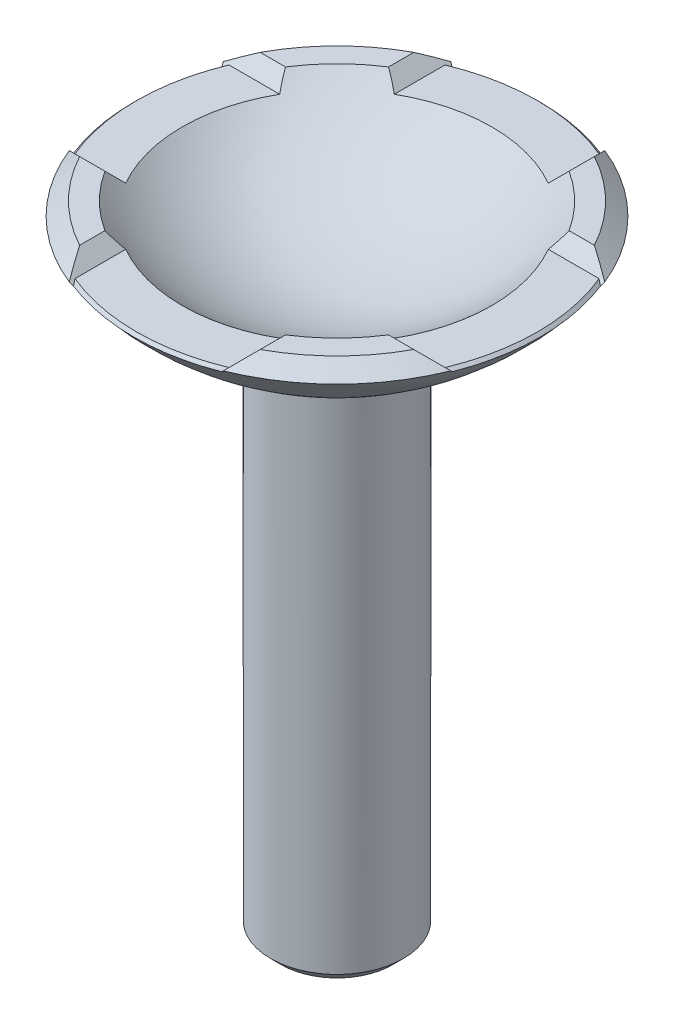
ISO-10303-21;
HEADER;
FILE_DESCRIPTION(('STEP AP214'),'2;1');
FILE_NAME('part.step','',(''),(''),'','','');
FILE_SCHEMA(('AUTOMOTIVE_DESIGN { 1 0 10303 214 1 1 1 1 }'));
ENDSEC;
DATA;
#1=APPLICATION_CONTEXT('core data for automotive mechanical design processes');
#2=APPLICATION_PROTOCOL_DEFINITION('international standard','automotive_design',2000,#1);
#3=PRODUCT_CONTEXT('',#1,'mechanical');
#4=PRODUCT('Part','Part','',(#3));
#5=PRODUCT_RELATED_PRODUCT_CATEGORY('part','',(#4));
#6=PRODUCT_DEFINITION_FORMATION('','',#4);
#7=PRODUCT_DEFINITION_CONTEXT('part definition',#1,'design');
#8=PRODUCT_DEFINITION('design','',#6,#7);
#9=PRODUCT_DEFINITION_SHAPE('','',#8);
#10=(LENGTH_UNIT() NAMED_UNIT(*) SI_UNIT(.MILLI.,.METRE.));
#11=(NAMED_UNIT(*) PLANE_ANGLE_UNIT() SI_UNIT($,.RADIAN.));
#12=(NAMED_UNIT(*) SI_UNIT($,.STERADIAN.) SOLID_ANGLE_UNIT());
#13=UNCERTAINTY_MEASURE_WITH_UNIT(LENGTH_MEASURE(1.E-05),#10,'distance_accuracy_value','');
#14=(GEOMETRIC_REPRESENTATION_CONTEXT(3) GLOBAL_UNCERTAINTY_ASSIGNED_CONTEXT((#13)) GLOBAL_UNIT_ASSIGNED_CONTEXT((#10,
#11,#12)) REPRESENTATION_CONTEXT('',''));
#15=CARTESIAN_POINT('',(0.,0.,0.));
#16=DIRECTION('',(0.,0.,1.));
#17=DIRECTION('',(1.,0.,0.));
#18=AXIS2_PLACEMENT_3D('',#15,#16,#17);
#19=CARTESIAN_POINT('',(0.,121.298315106814,0.));
#20=DIRECTION('',(0.,-1.,0.));
#21=DIRECTION('',(0.,0.,-1.));
#22=AXIS2_PLACEMENT_3D('',#19,#20,#21);
#23=CONICAL_SURFACE('',#22,33.3741257021822,0.872664625997168);
#24=CARTESIAN_POINT('',(-14.4997999999999,116.798115106813,35.9211740051254));
#25=CARTESIAN_POINT('',(-14.9013423051626,117.199657411976,35.2429860829737));
#26=CARTESIAN_POINT('',(-15.2972412548213,117.595556361635,34.5580480123078));
#27=CARTESIAN_POINT('',(-16.0760419228973,118.374357029711,33.1744582347738));
#28=CARTESIAN_POINT('',(-16.4589538130482,118.757268919862,32.4758179699098));
#29=CARTESIAN_POINT('',(-17.210776831169,119.509091937983,31.0634153506994));
#30=CARTESIAN_POINT('',(-17.5796857794549,119.878000886268,30.3496506688272));
#31=CARTESIAN_POINT('',(-18.3020478583758,120.600362965189,28.9058010991309));
#32=CARTESIAN_POINT('',(-18.6554883357561,120.95380344257,28.1757035623034));
#33=CARTESIAN_POINT('',(-19.0002,121.298515106814,27.4373606038953));
#34=B_SPLINE_CURVE_WITH_KNOTS('',3,(#24,#25,#26,#27,#28,#29,#30,#31,#32,#33),.UNSPECIFIED.,.F.,
.F.,(4,2,2,2,4),(0.,2.65363308068676,5.30513738997468,7.95705275125017,10.6110983205844),.UNSPECIFIED.);
#35=CARTESIAN_POINT('',(-14.5000000000001,116.798315106814,35.9208362360628));
#36=VERTEX_POINT('',#35);
#37=CARTESIAN_POINT('',(-17.0000000000001,119.298315106814,31.4580404619864));
#38=VERTEX_POINT('',#37);
#39=EDGE_CURVE('E245',#36,#38,#34,.T.);
#40=ORIENTED_EDGE('',*,*,#39,.T.);
#41=CARTESIAN_POINT('',(0.,119.298315106814,0.));
#42=DIRECTION('',(0.,-1.,0.));
#43=DIRECTION('',(0.,0.,-1.));
#44=AXIS2_PLACEMENT_3D('',#41,#42,#43);
#45=CIRCLE('',#44,35.7576328873707);
#46=CARTESIAN_POINT('',(-31.4580404619864,119.298315106814,17.));
#47=VERTEX_POINT('',#46);
#48=EDGE_CURVE('E504',#38,#47,#45,.T.);
#49=ORIENTED_EDGE('',*,*,#48,.T.);
#50=CARTESIAN_POINT('',(-27.4373606038954,121.298515106814,19.0002));
#51=CARTESIAN_POINT('',(-28.1757035623035,120.95380344257,18.6554883357561));
#52=CARTESIAN_POINT('',(-28.9058010991309,120.600362965189,18.3020478583757));
#53=CARTESIAN_POINT('',(-30.3496506688272,119.878000886269,17.5796857794548));
#54=CARTESIAN_POINT('',(-31.0634153506993,119.509091937983,17.210776831169));
#55=CARTESIAN_POINT('',(-32.4758179699096,118.757268919862,16.4589538130482));
#56=CARTESIAN_POINT('',(-33.1744582347736,118.374357029711,16.0760419228974));
#57=CARTESIAN_POINT('',(-34.5580480123075,117.595556361635,15.2972412548214));
#58=CARTESIAN_POINT('',(-35.2429860829733,117.199657411976,14.9013423051627));
#59=CARTESIAN_POINT('',(-35.921174005125,116.798115106814,14.4998));
#60=B_SPLINE_CURVE_WITH_KNOTS('',3,(#50,#51,#52,#53,#54,#55,#56,#57,#58,#59),.UNSPECIFIED.,.F.,
.F.,(4,2,2,2,4),(0.,2.65404556933415,5.30596093060948,7.95746523989727,10.6110983205839),.UNSPECIFIED.);
#61=CARTESIAN_POINT('',(-35.9208362360629,116.798315106814,14.5));
#62=VERTEX_POINT('',#61);
#63=EDGE_CURVE('E465',#47,#62,#60,.T.);
#64=ORIENTED_EDGE('',*,*,#63,.T.);
#65=CARTESIAN_POINT('',(0.,116.798315106814,0.));
#66=DIRECTION('',(0.,-1.,0.));
#67=DIRECTION('',(0.,0.,-1.));
#68=AXIS2_PLACEMENT_3D('',#65,#66,#67);
#69=CIRCLE('',#68,38.7370168688562);
#70=EDGE_CURVE('E459',#36,#62,#69,.T.);
#71=ORIENTED_EDGE('',*,*,#70,.F.);
#72=EDGE_LOOP('',(#40,#49,#64,#71));
#73=FACE_BOUND('',#72,.T.);
#74=ADVANCED_FACE('F51',(#73),#23,.T.);
#75=CARTESIAN_POINT('',(-35.921174005125,116.798115106814,-14.4998));
#76=CARTESIAN_POINT('',(-35.2429860829733,117.199657411976,-14.9013423051627));
#77=CARTESIAN_POINT('',(-34.5580480123075,117.595556361635,-15.2972412548214));
#78=CARTESIAN_POINT('',(-33.1744582347736,118.374357029711,-16.0760419228974));
#79=CARTESIAN_POINT('',(-32.4758179699096,118.757268919862,-16.4589538130482));
#80=CARTESIAN_POINT('',(-31.0634153506993,119.509091937983,-17.210776831169));
#81=CARTESIAN_POINT('',(-30.3496506688272,119.878000886269,-17.5796857794548));
#82=CARTESIAN_POINT('',(-28.9058010991309,120.600362965189,-18.3020478583757));
#83=CARTESIAN_POINT('',(-28.1757035623035,120.95380344257,-18.6554883357561));
#84=CARTESIAN_POINT('',(-27.4373606038954,121.298515106814,-19.0002));
#85=B_SPLINE_CURVE_WITH_KNOTS('',3,(#75,#76,#77,#78,#79,#80,#81,#82,#83,#84),.UNSPECIFIED.,.F.,
.F.,(4,2,2,2,4),(0.,2.65363308068661,5.3051373899744,7.95705275124973,10.6110983205839),.UNSPECIFIED.);
#86=CARTESIAN_POINT('',(-35.9208362360629,116.798315106814,-14.5));
#87=VERTEX_POINT('',#86);
#88=CARTESIAN_POINT('',(-31.4580404619864,119.298315106814,-17.));
#89=VERTEX_POINT('',#88);
#90=EDGE_CURVE('E361',#87,#89,#85,.T.);
#91=ORIENTED_EDGE('',*,*,#90,.T.);
#92=CARTESIAN_POINT('',(0.,119.298315106814,0.));
#93=DIRECTION('',(0.,-1.,0.));
#94=DIRECTION('',(0.,0.,-1.));
#95=AXIS2_PLACEMENT_3D('',#92,#93,#94);
#96=CIRCLE('',#95,35.7576328873707);
#97=CARTESIAN_POINT('',(-16.9999999999998,119.298315106814,-31.4580404619865));
#98=VERTEX_POINT('',#97);
#99=EDGE_CURVE('E637',#89,#98,#96,.T.);
#100=ORIENTED_EDGE('',*,*,#99,.T.);
#101=CARTESIAN_POINT('',(-19.0002000000001,121.298515106814,-27.437360603895));
#102=CARTESIAN_POINT('',(-18.6554883357561,120.95380344257,-28.1757035623032));
#103=CARTESIAN_POINT('',(-18.3020478583758,120.60036296519,-28.9058010991306));
#104=CARTESIAN_POINT('',(-17.5796857794549,119.878000886269,-30.349650668827));
#105=CARTESIAN_POINT('',(-17.210776831169,119.509091937983,-31.0634153506992));
#106=CARTESIAN_POINT('',(-16.4589538130482,118.757268919862,-32.4758179699095));
#107=CARTESIAN_POINT('',(-16.0760419228973,118.374357029711,-33.1744582347735));
#108=CARTESIAN_POINT('',(-15.2972412548213,117.595556361635,-34.5580480123075));
#109=CARTESIAN_POINT('',(-14.9013423051626,117.199657411976,-35.2429860829733));
#110=CARTESIAN_POINT('',(-14.4997999999999,116.798115106814,-35.921174005125));
#111=B_SPLINE_CURVE_WITH_KNOTS('',3,(#101,#102,#103,#104,#105,#106,#107,#108,#109,#110),
.UNSPECIFIED.,.F.,.F.,(4,2,2,2,4),(0.,2.65404556933427,5.30596093060974,7.95746523989765,
10.6110983205844),.UNSPECIFIED.);
#112=CARTESIAN_POINT('',(-14.4999999999999,116.798315106814,-35.9208362360629));
#113=VERTEX_POINT('',#112);
#114=EDGE_CURVE('E510',#98,#113,#111,.T.);
#115=ORIENTED_EDGE('',*,*,#114,.T.);
#116=EDGE_CURVE('E463',#87,#113,#69,.T.);
#117=ORIENTED_EDGE('',*,*,#116,.F.);
#118=EDGE_LOOP('',(#91,#100,#115,#117));
#119=FACE_BOUND('',#118,.T.);
#120=ADVANCED_FACE('F494',(#119),#23,.T.);
#121=CARTESIAN_POINT('',(35.921174005125,116.798115106814,14.4998));
#122=CARTESIAN_POINT('',(35.2429860829733,117.199657411976,14.9013423051627));
#123=CARTESIAN_POINT('',(34.5580480123075,117.595556361635,15.2972412548214));
#124=CARTESIAN_POINT('',(33.1744582347736,118.374357029711,16.0760419228974));
#125=CARTESIAN_POINT('',(32.4758179699096,118.757268919862,16.4589538130482));
#126=CARTESIAN_POINT('',(31.0634153506994,119.509091937983,17.2107768311689));
#127=CARTESIAN_POINT('',(30.3496506688272,119.878000886269,17.5796857794548));
#128=CARTESIAN_POINT('',(28.9058010991309,120.600362965189,18.3020478583757));
#129=CARTESIAN_POINT('',(28.1757035623035,120.95380344257,18.655488335756));
#130=CARTESIAN_POINT('',(27.4373606038954,121.298515106814,19.0001999999999));
#131=B_SPLINE_CURVE_WITH_KNOTS('',3,(#121,#122,#123,#124,#125,#126,#127,#128,#129,#130),
.UNSPECIFIED.,.F.,.F.,(4,2,2,2,4),(0.,2.6536330806866,5.30513738997437,7.95705275124969,
10.6110983205838),.UNSPECIFIED.);
#132=CARTESIAN_POINT('',(35.9208362360629,116.798315106814,14.5));
#133=VERTEX_POINT('',#132);
#134=CARTESIAN_POINT('',(31.4580404619864,119.298315106814,17.));
#135=VERTEX_POINT('',#134);
#136=EDGE_CURVE('E233',#133,#135,#131,.T.);
#137=ORIENTED_EDGE('',*,*,#136,.T.);
#138=CARTESIAN_POINT('',(0.,119.298315106814,0.));
#139=DIRECTION('',(0.,-1.,0.));
#140=DIRECTION('',(0.,0.,-1.));
#141=AXIS2_PLACEMENT_3D('',#138,#139,#140);
#142=CIRCLE('',#141,35.7576328873707);
#143=CARTESIAN_POINT('',(16.9999999999998,119.298315106814,31.4580404619865));
#144=VERTEX_POINT('',#143);
#145=EDGE_CURVE('E217',#135,#144,#142,.T.);
#146=ORIENTED_EDGE('',*,*,#145,.T.);
#147=CARTESIAN_POINT('',(19.0002000000001,121.298515106814,27.437360603895));
#148=CARTESIAN_POINT('',(18.6554883357561,120.95380344257,28.1757035623031));
#149=CARTESIAN_POINT('',(18.3020478583758,120.60036296519,28.9058010991306));
#150=CARTESIAN_POINT('',(17.5796857794549,119.878000886269,30.3496506688269));
#151=CARTESIAN_POINT('',(17.210776831169,119.509091937983,31.0634153506991));
#152=CARTESIAN_POINT('',(16.4589538130482,118.757268919862,32.4758179699095));
#153=CARTESIAN_POINT('',(16.0760419228973,118.374357029711,33.1744582347735));
#154=CARTESIAN_POINT('',(15.2972412548213,117.595556361635,34.5580480123075));
#155=CARTESIAN_POINT('',(14.9013423051626,117.199657411976,35.2429860829733));
#156=CARTESIAN_POINT('',(14.4997999999999,116.798115106814,35.921174005125));
#157=B_SPLINE_CURVE_WITH_KNOTS('',3,(#147,#148,#149,#150,#151,#152,#153,#154,#155,#156),
.UNSPECIFIED.,.F.,.F.,(4,2,2,2,4),(0.,2.65404556933427,5.30596093060973,7.95746523989766,
10.6110983205844),.UNSPECIFIED.);
#158=CARTESIAN_POINT('',(14.4999999999999,116.798315106814,35.9208362360629));
#159=VERTEX_POINT('',#158);
#160=EDGE_CURVE('E231',#144,#159,#157,.T.);
#161=ORIENTED_EDGE('',*,*,#160,.T.);
#162=EDGE_CURVE('E458',#133,#159,#69,.T.);
#163=ORIENTED_EDGE('',*,*,#162,.F.);
#164=EDGE_LOOP('',(#137,#146,#161,#163));
#165=FACE_BOUND('',#164,.T.);
#166=ADVANCED_FACE('F229',(#165),#23,.T.);
#167=CARTESIAN_POINT('',(0.,0.,0.));
#168=DIRECTION('',(0.,1.,0.));
#169=DIRECTION('',(0.,0.,1.));
#170=AXIS2_PLACEMENT_3D('',#167,#168,#169);
#171=PLANE('',#170);
#172=CARTESIAN_POINT('',(0.,0.,0.));
#173=DIRECTION('',(0.,1.,0.));
#174=DIRECTION('',(0.,0.,1.));
#175=AXIS2_PLACEMENT_3D('',#172,#173,#174);
#176=CIRCLE('',#175,10.5);
#177=CARTESIAN_POINT('',(0.,0.,10.5));
#178=VERTEX_POINT('',#177);
#179=EDGE_CURVE('E60',#178,#178,#176,.F.);
#180=ORIENTED_EDGE('',*,*,#179,.T.);
#181=EDGE_LOOP('',(#180));
#182=FACE_BOUND('',#181,.T.);
#183=ADVANCED_FACE('F571',(#182),#171,.F.);
#184=CARTESIAN_POINT('',(0.,0.,0.));
#185=DIRECTION('',(0.,-1.,0.));
#186=DIRECTION('',(0.,0.,-1.));
#187=AXIS2_PLACEMENT_3D('',#184,#185,#186);
#188=CYLINDRICAL_SURFACE('',#187,12.5);
#189=CARTESIAN_POINT('',(0.,2.00000000000001,0.));
#190=DIRECTION('',(0.,1.,0.));
#191=DIRECTION('',(0.,0.,1.));
#192=AXIS2_PLACEMENT_3D('',#189,#190,#191);
#193=CIRCLE('',#192,12.5);
#194=CARTESIAN_POINT('',(0.,2.00000000000001,12.5));
#195=VERTEX_POINT('',#194);
#196=EDGE_CURVE('E13',#195,#195,#193,.T.);
#197=ORIENTED_EDGE('',*,*,#196,.T.);
#198=EDGE_LOOP('',(#197));
#199=FACE_BOUND('',#198,.T.);
#200=CARTESIAN_POINT('',(0.,100.,0.));
#201=DIRECTION('',(0.,-1.,0.));
#202=DIRECTION('',(0.,0.,-1.));
#203=AXIS2_PLACEMENT_3D('',#200,#201,#202);
#204=CIRCLE('',#203,12.5);
#205=CARTESIAN_POINT('',(0.,100.,-12.5));
#206=VERTEX_POINT('',#205);
#207=EDGE_CURVE('E454',#206,#206,#204,.T.);
#208=ORIENTED_EDGE('',*,*,#207,.T.);
#209=EDGE_LOOP('',(#208));
#210=FACE_BOUND('',#209,.T.);
#211=ADVANCED_FACE('F581',(#199,#210),#188,.T.);
#212=CARTESIAN_POINT('',(0.,148.412291827593,0.));
#213=DIRECTION('',(0.,-1.,0.));
#214=DIRECTION('',(-1.,0.,0.));
#215=AXIS2_PLACEMENT_3D('',#212,#213,#214);
#216=SPHERICAL_SURFACE('',#215,50.);
#217=ORIENTED_EDGE('',*,*,#207,.F.);
#218=EDGE_LOOP('',(#217));
#219=FACE_BOUND('',#218,.T.);
#220=CARTESIAN_POINT('',(0.,116.251275155448,0.));
#221=DIRECTION('',(0.,1.,0.));
#222=DIRECTION('',(0.,0.,1.));
#223=AXIS2_PLACEMENT_3D('',#220,#221,#222);
#224=CIRCLE('',#223,38.2840568202223);
#225=CARTESIAN_POINT('',(-35.650861314914,116.251275155448,13.9529600486339));
#226=VERTEX_POINT('',#225);
#227=CARTESIAN_POINT('',(-35.650861314914,116.251275155448,-13.9529600486339));
#228=VERTEX_POINT('',#227);
#229=EDGE_CURVE('E389',#226,#228,#224,.F.);
#230=ORIENTED_EDGE('',*,*,#229,.T.);
#231=CARTESIAN_POINT('',(0.,125.355303467203,-23.0569883603896));
#232=DIRECTION('',(0.,-0.707106781186545,-0.70710678118655));
#233=DIRECTION('',(0.,0.70710678118655,-0.707106781186545));
#234=AXIS2_PLACEMENT_3D('',#231,#232,#233);
#235=CIRCLE('',#234,37.9044928141471);
#236=EDGE_CURVE('E386',#228,#87,#235,.T.);
#237=ORIENTED_EDGE('',*,*,#236,.T.);
#238=ORIENTED_EDGE('',*,*,#116,.T.);
#239=CARTESIAN_POINT('',(-23.0569883603896,125.355303467203,0.));
#240=DIRECTION('',(-0.70710678118655,-0.707106781186545,0.));
#241=DIRECTION('',(0.707106781186545,-0.70710678118655,0.));
#242=AXIS2_PLACEMENT_3D('',#239,#240,#241);
#243=CIRCLE('',#242,37.9044928141471);
#244=CARTESIAN_POINT('',(-13.9529600486338,116.251275155448,-35.6508613149141));
#245=VERTEX_POINT('',#244);
#246=EDGE_CURVE('E404',#113,#245,#243,.T.);
#247=ORIENTED_EDGE('',*,*,#246,.T.);
#248=CARTESIAN_POINT('',(0.,116.251275155448,0.));
#249=DIRECTION('',(0.,1.,0.));
#250=DIRECTION('',(0.,0.,1.));
#251=AXIS2_PLACEMENT_3D('',#248,#249,#250);
#252=CIRCLE('',#251,38.2840568202223);
#253=CARTESIAN_POINT('',(13.952960048634,116.251275155448,-35.650861314914));
#254=VERTEX_POINT('',#253);
#255=EDGE_CURVE('E400',#245,#254,#252,.F.);
#256=ORIENTED_EDGE('',*,*,#255,.T.);
#257=CARTESIAN_POINT('',(23.0569883603896,125.355303467203,0.));
#258=DIRECTION('',(0.70710678118655,-0.707106781186545,0.));
#259=DIRECTION('',(0.707106781186545,0.70710678118655,0.));
#260=AXIS2_PLACEMENT_3D('',#257,#258,#259);
#261=CIRCLE('',#260,37.9044928141471);
#262=CARTESIAN_POINT('',(14.5000000000001,116.798315106814,-35.9208362360628));
#263=VERTEX_POINT('',#262);
#264=EDGE_CURVE('E397',#254,#263,#261,.T.);
#265=ORIENTED_EDGE('',*,*,#264,.T.);
#266=CARTESIAN_POINT('',(35.9208362360629,116.798315106814,-14.5));
#267=VERTEX_POINT('',#266);
#268=EDGE_CURVE('E464',#263,#267,#69,.T.);
#269=ORIENTED_EDGE('',*,*,#268,.T.);
#270=CARTESIAN_POINT('',(0.,125.355303467203,-23.0569883603896));
#271=DIRECTION('',(0.,-0.707106781186545,-0.70710678118655));
#272=DIRECTION('',(0.,0.70710678118655,-0.707106781186545));
#273=AXIS2_PLACEMENT_3D('',#270,#271,#272);
#274=CIRCLE('',#273,37.9044928141471);
#275=CARTESIAN_POINT('',(35.650861314914,116.251275155448,-13.9529600486339));
#276=VERTEX_POINT('',#275);
#277=EDGE_CURVE('E75',#267,#276,#274,.T.);
#278=ORIENTED_EDGE('',*,*,#277,.T.);
#279=CARTESIAN_POINT('',(0.,116.251275155448,0.));
#280=DIRECTION('',(0.,1.,0.));
#281=DIRECTION('',(0.,0.,1.));
#282=AXIS2_PLACEMENT_3D('',#279,#280,#281);
#283=CIRCLE('',#282,38.2840568202223);
#284=CARTESIAN_POINT('',(35.650861314914,116.251275155448,13.9529600486339));
#285=VERTEX_POINT('',#284);
#286=EDGE_CURVE('E411',#276,#285,#283,.F.);
#287=ORIENTED_EDGE('',*,*,#286,.T.);
#288=CARTESIAN_POINT('',(0.,125.355303467203,23.0569883603896));
#289=DIRECTION('',(0.,-0.707106781186545,0.70710678118655));
#290=DIRECTION('',(0.,-0.70710678118655,-0.707106781186545));
#291=AXIS2_PLACEMENT_3D('',#288,#289,#290);
#292=CIRCLE('',#291,37.9044928141471);
#293=EDGE_CURVE('E408',#285,#133,#292,.T.);
#294=ORIENTED_EDGE('',*,*,#293,.T.);
#295=ORIENTED_EDGE('',*,*,#162,.T.);
#296=CARTESIAN_POINT('',(23.0569883603896,125.355303467203,0.));
#297=DIRECTION('',(0.70710678118655,-0.707106781186545,0.));
#298=DIRECTION('',(0.707106781186545,0.70710678118655,0.));
#299=AXIS2_PLACEMENT_3D('',#296,#297,#298);
#300=CIRCLE('',#299,37.9044928141471);
#301=CARTESIAN_POINT('',(13.9529600486338,116.251275155448,35.6508613149141));
#302=VERTEX_POINT('',#301);
#303=EDGE_CURVE('E67',#159,#302,#300,.T.);
#304=ORIENTED_EDGE('',*,*,#303,.T.);
#305=CARTESIAN_POINT('',(0.,116.251275155448,0.));
#306=DIRECTION('',(0.,1.,0.));
#307=DIRECTION('',(0.,0.,1.));
#308=AXIS2_PLACEMENT_3D('',#305,#306,#307);
#309=CIRCLE('',#308,38.2840568202223);
#310=CARTESIAN_POINT('',(-13.952960048634,116.251275155448,35.650861314914));
#311=VERTEX_POINT('',#310);
#312=EDGE_CURVE('E420',#302,#311,#309,.F.);
#313=ORIENTED_EDGE('',*,*,#312,.T.);
#314=CARTESIAN_POINT('',(-23.0569883603896,125.355303467203,0.));
#315=DIRECTION('',(-0.70710678118655,-0.707106781186545,0.));
#316=DIRECTION('',(0.707106781186545,-0.70710678118655,0.));
#317=AXIS2_PLACEMENT_3D('',#314,#315,#316);
#318=CIRCLE('',#317,37.9044928141471);
#319=EDGE_CURVE('E417',#311,#36,#318,.T.);
#320=ORIENTED_EDGE('',*,*,#319,.T.);
#321=ORIENTED_EDGE('',*,*,#70,.T.);
#322=CARTESIAN_POINT('',(0.,125.355303467203,23.0569883603896));
#323=DIRECTION('',(0.,-0.707106781186545,0.70710678118655));
#324=DIRECTION('',(0.,-0.70710678118655,-0.707106781186545));
#325=AXIS2_PLACEMENT_3D('',#322,#323,#324);
#326=CIRCLE('',#325,37.9044928141471);
#327=EDGE_CURVE('E393',#62,#226,#326,.T.);
#328=ORIENTED_EDGE('',*,*,#327,.T.);
#329=EDGE_LOOP('',(#230,#237,#238,#247,#256,#265,#269,#278,#287,#294,#295,#304,#313,#320,#321,#328));
#330=FACE_BOUND('',#329,.T.);
#331=ADVANCED_FACE('F491',(#219,#330),#216,.T.);
#332=CARTESIAN_POINT('',(14.4997999999999,116.798115106813,-35.9211740051254));
#333=CARTESIAN_POINT('',(14.9013423051626,117.199657411976,-35.2429860829737));
#334=CARTESIAN_POINT('',(15.2972412548213,117.595556361635,-34.5580480123078));
#335=CARTESIAN_POINT('',(16.0760419228973,118.374357029711,-33.1744582347738));
#336=CARTESIAN_POINT('',(16.4589538130482,118.757268919862,-32.4758179699098));
#337=CARTESIAN_POINT('',(17.210776831169,119.509091937983,-31.0634153506994));
#338=CARTESIAN_POINT('',(17.5796857794549,119.878000886268,-30.3496506688272));
#339=CARTESIAN_POINT('',(18.3020478583758,120.600362965189,-28.9058010991309));
#340=CARTESIAN_POINT('',(18.6554883357561,120.95380344257,-28.1757035623034));
#341=CARTESIAN_POINT('',(19.0002,121.298515106814,-27.4373606038953));
#342=B_SPLINE_CURVE_WITH_KNOTS('',3,(#332,#333,#334,#335,#336,#337,#338,#339,#340,#341),
.UNSPECIFIED.,.F.,.F.,(4,2,2,2,4),(0.,2.65363308068676,5.30513738997468,7.95705275125016,
10.6110983205844),.UNSPECIFIED.);
#343=CARTESIAN_POINT('',(17.0000000000001,119.298315106814,-31.4580404619863));
#344=VERTEX_POINT('',#343);
#345=EDGE_CURVE('E239',#263,#344,#342,.T.);
#346=ORIENTED_EDGE('',*,*,#345,.T.);
#347=CARTESIAN_POINT('',(0.,119.298315106814,0.));
#348=DIRECTION('',(0.,-1.,0.));
#349=DIRECTION('',(0.,0.,-1.));
#350=AXIS2_PLACEMENT_3D('',#347,#348,#349);
#351=CIRCLE('',#350,35.7576328873707);
#352=CARTESIAN_POINT('',(31.4580404619864,119.298315106814,-17.));
#353=VERTEX_POINT('',#352);
#354=EDGE_CURVE('E615',#344,#353,#351,.T.);
#355=ORIENTED_EDGE('',*,*,#354,.T.);
#356=CARTESIAN_POINT('',(27.4373606038954,121.298515106814,-19.0001999999999));
#357=CARTESIAN_POINT('',(28.1757035623035,120.95380344257,-18.655488335756));
#358=CARTESIAN_POINT('',(28.9058010991309,120.600362965189,-18.3020478583757));
#359=CARTESIAN_POINT('',(30.3496506688272,119.878000886269,-17.5796857794548));
#360=CARTESIAN_POINT('',(31.0634153506994,119.509091937983,-17.2107768311689));
#361=CARTESIAN_POINT('',(32.4758179699096,118.757268919862,-16.4589538130482));
#362=CARTESIAN_POINT('',(33.1744582347736,118.374357029711,-16.0760419228974));
#363=CARTESIAN_POINT('',(34.5580480123075,117.595556361635,-15.2972412548214));
#364=CARTESIAN_POINT('',(35.2429860829733,117.199657411976,-14.9013423051627));
#365=CARTESIAN_POINT('',(35.921174005125,116.798115106814,-14.4998));
#366=B_SPLINE_CURVE_WITH_KNOTS('',3,(#356,#357,#358,#359,#360,#361,#362,#363,#364,#365),
.UNSPECIFIED.,.F.,.F.,(4,2,2,2,4),(0.,2.65404556933412,5.30596093060945,7.95746523989721,
10.6110983205838),.UNSPECIFIED.);
#367=EDGE_CURVE('E353',#353,#267,#366,.T.);
#368=ORIENTED_EDGE('',*,*,#367,.T.);
#369=ORIENTED_EDGE('',*,*,#268,.F.);
#370=EDGE_LOOP('',(#346,#355,#368,#369));
#371=FACE_BOUND('',#370,.T.);
#372=ADVANCED_FACE('F262',(#371),#23,.T.);
#373=CARTESIAN_POINT('',(0.,148.412291827593,0.));
#374=DIRECTION('',(0.,-1.,0.));
#375=DIRECTION('',(1.,0.,0.));
#376=AXIS2_PLACEMENT_3D('',#373,#374,#375);
#377=SPHERICAL_SURFACE('',#376,43.);
#378=CARTESIAN_POINT('',(-23.0569883603896,125.355303467203,0.));
#379=DIRECTION('',(-0.70710678118655,-0.707106781186545,0.));
#380=DIRECTION('',(0.707106781186545,-0.70710678118655,0.));
#381=AXIS2_PLACEMENT_3D('',#378,#379,#380);
#382=CIRCLE('',#381,28.0312428461125);
#383=CARTESIAN_POINT('',(-14.4999999999999,116.798315106814,-25.284510592417));
#384=VERTEX_POINT('',#383);
#385=CARTESIAN_POINT('',(-16.9999999999999,119.298315106814,-26.6903795308711));
#386=VERTEX_POINT('',#385);
#387=EDGE_CURVE('E426',#384,#386,#382,.F.);
#388=ORIENTED_EDGE('',*,*,#387,.T.);
#389=CARTESIAN_POINT('',(0.,119.298315106814,0.));
#390=DIRECTION('',(0.,-1.,0.));
#391=DIRECTION('',(0.,0.,-1.));
#392=AXIS2_PLACEMENT_3D('',#389,#390,#391);
#393=CIRCLE('',#392,31.6445312732222);
#394=CARTESIAN_POINT('',(-26.6903795308711,119.298315106814,-17.));
#395=VERTEX_POINT('',#394);
#396=EDGE_CURVE('E636',#386,#395,#393,.F.);
#397=ORIENTED_EDGE('',*,*,#396,.T.);
#398=CARTESIAN_POINT('',(0.,125.355303467203,-23.0569883603896));
#399=DIRECTION('',(0.,-0.707106781186545,-0.70710678118655));
#400=DIRECTION('',(0.,0.70710678118655,-0.707106781186545));
#401=AXIS2_PLACEMENT_3D('',#398,#399,#400);
#402=CIRCLE('',#401,28.0312428461125);
#403=CARTESIAN_POINT('',(-25.284510592417,116.798315106814,-14.5));
#404=VERTEX_POINT('',#403);
#405=EDGE_CURVE('E450',#395,#404,#402,.F.);
#406=ORIENTED_EDGE('',*,*,#405,.T.);
#407=CARTESIAN_POINT('',(0.,116.798315106814,0.));
#408=DIRECTION('',(0.,-1.,0.));
#409=DIRECTION('',(0.,0.,-1.));
#410=AXIS2_PLACEMENT_3D('',#407,#408,#409);
#411=CIRCLE('',#410,29.1471521061329);
#412=CARTESIAN_POINT('',(-25.284510592417,116.798315106814,14.5));
#413=VERTEX_POINT('',#412);
#414=EDGE_CURVE('E444',#404,#413,#411,.F.);
#415=ORIENTED_EDGE('',*,*,#414,.T.);
#416=CARTESIAN_POINT('',(0.,125.355303467203,23.0569883603896));
#417=DIRECTION('',(0.,-0.707106781186545,0.70710678118655));
#418=DIRECTION('',(0.,-0.70710678118655,-0.707106781186545));
#419=AXIS2_PLACEMENT_3D('',#416,#417,#418);
#420=CIRCLE('',#419,28.0312428461125);
#421=CARTESIAN_POINT('',(-26.6903795308711,119.298315106814,17.));
#422=VERTEX_POINT('',#421);
#423=EDGE_CURVE('E440',#413,#422,#420,.F.);
#424=ORIENTED_EDGE('',*,*,#423,.T.);
#425=CARTESIAN_POINT('',(-17.,119.298315106814,26.690379530871));
#426=VERTEX_POINT('',#425);
#427=EDGE_CURVE('E674',#422,#426,#393,.F.);
#428=ORIENTED_EDGE('',*,*,#427,.T.);
#429=CARTESIAN_POINT('',(-14.5000000000001,116.798315106814,25.2845105924169));
#430=VERTEX_POINT('',#429);
#431=EDGE_CURVE('E224',#426,#430,#382,.F.);
#432=ORIENTED_EDGE('',*,*,#431,.T.);
#433=CARTESIAN_POINT('',(0.,116.798315106814,0.));
#434=DIRECTION('',(0.,-1.,0.));
#435=DIRECTION('',(0.,0.,-1.));
#436=AXIS2_PLACEMENT_3D('',#433,#434,#435);
#437=CIRCLE('',#436,29.1471521061329);
#438=CARTESIAN_POINT('',(14.4999999999999,116.798315106814,25.284510592417));
#439=VERTEX_POINT('',#438);
#440=EDGE_CURVE('E430',#430,#439,#437,.F.);
#441=ORIENTED_EDGE('',*,*,#440,.T.);
#442=CARTESIAN_POINT('',(23.0569883603896,125.355303467203,0.));
#443=DIRECTION('',(0.70710678118655,-0.707106781186545,0.));
#444=DIRECTION('',(0.707106781186545,0.70710678118655,0.));
#445=AXIS2_PLACEMENT_3D('',#442,#443,#444);
#446=CIRCLE('',#445,28.0312428461125);
#447=CARTESIAN_POINT('',(16.9999999999999,119.298315106814,26.6903795308711));
#448=VERTEX_POINT('',#447);
#449=EDGE_CURVE('E436',#439,#448,#446,.F.);
#450=ORIENTED_EDGE('',*,*,#449,.T.);
#451=CARTESIAN_POINT('',(26.6903795308711,119.298315106814,17.));
#452=VERTEX_POINT('',#451);
#453=EDGE_CURVE('E220',#448,#452,#393,.F.);
#454=ORIENTED_EDGE('',*,*,#453,.T.);
#455=CARTESIAN_POINT('',(25.284510592417,116.798315106814,14.5));
#456=VERTEX_POINT('',#455);
#457=EDGE_CURVE('E441',#452,#456,#420,.F.);
#458=ORIENTED_EDGE('',*,*,#457,.T.);
#459=CARTESIAN_POINT('',(25.284510592417,116.798315106814,-14.5));
#460=VERTEX_POINT('',#459);
#461=EDGE_CURVE('E449',#456,#460,#411,.F.);
#462=ORIENTED_EDGE('',*,*,#461,.T.);
#463=CARTESIAN_POINT('',(26.6903795308711,119.298315106814,-17.));
#464=VERTEX_POINT('',#463);
#465=EDGE_CURVE('E445',#460,#464,#402,.F.);
#466=ORIENTED_EDGE('',*,*,#465,.T.);
#467=CARTESIAN_POINT('',(17.0000000000001,119.298315106814,-26.690379530871));
#468=VERTEX_POINT('',#467);
#469=EDGE_CURVE('E623',#464,#468,#393,.F.);
#470=ORIENTED_EDGE('',*,*,#469,.T.);
#471=CARTESIAN_POINT('',(14.5000000000001,116.798315106814,-25.2845105924169));
#472=VERTEX_POINT('',#471);
#473=EDGE_CURVE('E431',#468,#472,#446,.F.);
#474=ORIENTED_EDGE('',*,*,#473,.T.);
#475=EDGE_CURVE('E435',#472,#384,#437,.F.);
#476=ORIENTED_EDGE('',*,*,#475,.T.);
#477=EDGE_LOOP('',(#388,#397,#406,#415,#424,#428,#432,#441,#450,#454,#458,#462,#466,#470,#474,#476));
#478=FACE_BOUND('',#477,.T.);
#479=ADVANCED_FACE('F480',(#478),#377,.F.);
#480=CARTESIAN_POINT('',(-38.7370168688562,116.798315106814,-14.5));
#481=DIRECTION('',(0.,-1.,0.));
#482=DIRECTION('',(0.,0.,-1.));
#483=AXIS2_PLACEMENT_3D('',#480,#481,#482);
#484=PLANE('',#483);
#485=DIRECTION('',(1.,0.,0.));
#486=VECTOR('',#485,1.);
#487=CARTESIAN_POINT('',(-38.7370168688562,116.798315106814,14.5));
#488=LINE('',#487,#486);
#489=CARTESIAN_POINT('',(34.8400981938963,116.798315106814,14.5));
#490=VERTEX_POINT('',#489);
#491=EDGE_CURVE('E513',#456,#490,#488,.T.);
#492=ORIENTED_EDGE('',*,*,#491,.T.);
#493=CARTESIAN_POINT('',(0.,116.798315106814,0.));
#494=DIRECTION('',(0.,-1.,0.));
#495=DIRECTION('',(0.,0.,-1.));
#496=AXIS2_PLACEMENT_3D('',#493,#494,#495);
#497=CIRCLE('',#496,37.7370168688561);
#498=CARTESIAN_POINT('',(34.8400981938963,116.798315106814,-14.5));
#499=VERTEX_POINT('',#498);
#500=EDGE_CURVE('E377',#490,#499,#497,.F.);
#501=ORIENTED_EDGE('',*,*,#500,.T.);
#502=DIRECTION('',(1.,0.,0.));
#503=VECTOR('',#502,1.);
#504=CARTESIAN_POINT('',(-38.7370168688562,116.798315106814,-14.5));
#505=LINE('',#504,#503);
#506=EDGE_CURVE('E524',#460,#499,#505,.T.);
#507=ORIENTED_EDGE('',*,*,#506,.F.);
#508=ORIENTED_EDGE('',*,*,#461,.F.);
#509=EDGE_LOOP('',(#492,#501,#507,#508));
#510=FACE_BOUND('',#509,.T.);
#511=ADVANCED_FACE('F349',(#510),#484,.F.);
#512=CARTESIAN_POINT('',(-38.7370168688562,121.298315106814,-18.9999999999999));
#513=DIRECTION('',(0.,-0.707106781186545,-0.70710678118655));
#514=DIRECTION('',(0.,0.70710678118655,-0.707106781186545));
#515=AXIS2_PLACEMENT_3D('',#512,#513,#514);
#516=PLANE('',#515);
#517=ORIENTED_EDGE('',*,*,#367,.F.);
#518=DIRECTION('',(-1.,0.,0.));
#519=VECTOR('',#518,1.);
#520=CARTESIAN_POINT('',(-38.7370168688562,119.298315106814,-17.));
#521=LINE('',#520,#519);
#522=EDGE_CURVE('E618',#353,#464,#521,.T.);
#523=ORIENTED_EDGE('',*,*,#522,.T.);
#524=ORIENTED_EDGE('',*,*,#465,.F.);
#525=ORIENTED_EDGE('',*,*,#506,.T.);
#526=CARTESIAN_POINT('',(34.8400981938963,116.798315106814,-14.5));
#527=CARTESIAN_POINT('',(34.9759660729135,116.707690656926,-14.4093755501119));
#528=CARTESIAN_POINT('',(35.1114636098294,116.616791766645,-14.3184766598314));
#529=CARTESIAN_POINT('',(35.381717983414,116.434445116125,-14.1361300093108));
#530=CARTESIAN_POINT('',(35.5164748201707,116.34299735595,-14.044682249136));
#531=CARTESIAN_POINT('',(35.650861314914,116.251275155448,-13.9529600486339));
#532=B_SPLINE_CURVE_WITH_KNOTS('',3,(#526,#527,#528,#529,#530,#531),.UNSPECIFIED.,.F.,.F.,(4,2,
4),(0.,0.560324183994026,1.12064830145823),.UNSPECIFIED.);
#533=EDGE_CURVE('E327',#499,#276,#532,.T.);
#534=ORIENTED_EDGE('',*,*,#533,.T.);
#535=ORIENTED_EDGE('',*,*,#277,.F.);
#536=EDGE_LOOP('',(#517,#523,#524,#525,#534,#535));
#537=FACE_BOUND('',#536,.T.);
#538=ADVANCED_FACE('F347',(#537),#516,.F.);
#539=CARTESIAN_POINT('',(-38.7370168688562,116.798315106814,14.5));
#540=DIRECTION('',(0.,-0.707106781186545,0.70710678118655));
#541=DIRECTION('',(0.,-0.70710678118655,-0.707106781186545));
#542=AXIS2_PLACEMENT_3D('',#539,#540,#541);
#543=PLANE('',#542);
#544=ORIENTED_EDGE('',*,*,#457,.F.);
#545=DIRECTION('',(1.,0.,0.));
#546=VECTOR('',#545,1.);
#547=CARTESIAN_POINT('',(-38.7370168688562,119.298315106814,17.));
#548=LINE('',#547,#546);
#549=EDGE_CURVE('E235',#452,#135,#548,.T.);
#550=ORIENTED_EDGE('',*,*,#549,.T.);
#551=ORIENTED_EDGE('',*,*,#136,.F.);
#552=ORIENTED_EDGE('',*,*,#293,.F.);
#553=CARTESIAN_POINT('',(35.650861314914,116.251275155448,13.9529600486339));
#554=CARTESIAN_POINT('',(35.5164748201707,116.34299735595,14.044682249136));
#555=CARTESIAN_POINT('',(35.381717983414,116.434445116125,14.1361300093108));
#556=CARTESIAN_POINT('',(35.1114636098294,116.616791766645,14.3184766598314));
#557=CARTESIAN_POINT('',(34.9759660729135,116.707690656926,14.4093755501119));
#558=CARTESIAN_POINT('',(34.8400981938963,116.798315106814,14.5));
#559=B_SPLINE_CURVE_WITH_KNOTS('',3,(#553,#554,#555,#556,#557,#558),.UNSPECIFIED.,.F.,.F.,(4,2,
4),(0.,0.560324117464202,1.12064830145823),.UNSPECIFIED.);
#560=EDGE_CURVE('E321',#285,#490,#559,.T.);
#561=ORIENTED_EDGE('',*,*,#560,.T.);
#562=ORIENTED_EDGE('',*,*,#491,.F.);
#563=EDGE_LOOP('',(#544,#550,#551,#552,#561,#562));
#564=FACE_BOUND('',#563,.T.);
#565=ADVANCED_FACE('F478',(#564),#543,.F.);
#566=ORIENTED_EDGE('',*,*,#63,.F.);
#567=DIRECTION('',(1.,0.,0.));
#568=VECTOR('',#567,1.);
#569=CARTESIAN_POINT('',(-38.7370168688562,119.298315106814,17.));
#570=LINE('',#569,#568);
#571=EDGE_CURVE('E545',#47,#422,#570,.T.);
#572=ORIENTED_EDGE('',*,*,#571,.T.);
#573=ORIENTED_EDGE('',*,*,#423,.F.);
#574=CARTESIAN_POINT('',(-34.8400981938963,116.798315106814,14.5));
#575=VERTEX_POINT('',#574);
#576=EDGE_CURVE('E528',#575,#413,#488,.T.);
#577=ORIENTED_EDGE('',*,*,#576,.F.);
#578=CARTESIAN_POINT('',(-34.8400981938963,116.798315106814,14.5));
#579=CARTESIAN_POINT('',(-34.9759660729135,116.707690656926,14.4093755501119));
#580=CARTESIAN_POINT('',(-35.1114636098294,116.616791766645,14.3184766598314));
#581=CARTESIAN_POINT('',(-35.381717983414,116.434445116125,14.1361300093108));
#582=CARTESIAN_POINT('',(-35.5164748201707,116.34299735595,14.044682249136));
#583=CARTESIAN_POINT('',(-35.650861314914,116.251275155448,13.9529600486339));
#584=B_SPLINE_CURVE_WITH_KNOTS('',3,(#578,#579,#580,#581,#582,#583),.UNSPECIFIED.,.F.,.F.,(4,2,
4),(0.,0.560324183994026,1.12064830145823),.UNSPECIFIED.);
#585=EDGE_CURVE('E292',#575,#226,#584,.T.);
#586=ORIENTED_EDGE('',*,*,#585,.T.);
#587=ORIENTED_EDGE('',*,*,#327,.F.);
#588=EDGE_LOOP('',(#566,#572,#573,#577,#586,#587));
#589=FACE_BOUND('',#588,.T.);
#590=ADVANCED_FACE('F345',(#589),#543,.F.);
#591=ORIENTED_EDGE('',*,*,#405,.F.);
#592=DIRECTION('',(-1.,0.,0.));
#593=VECTOR('',#592,1.);
#594=CARTESIAN_POINT('',(-38.7370168688562,119.298315106814,-17.));
#595=LINE('',#594,#593);
#596=EDGE_CURVE('E597',#395,#89,#595,.T.);
#597=ORIENTED_EDGE('',*,*,#596,.T.);
#598=ORIENTED_EDGE('',*,*,#90,.F.);
#599=ORIENTED_EDGE('',*,*,#236,.F.);
#600=CARTESIAN_POINT('',(-35.650861314914,116.251275155448,-13.9529600486339));
#601=CARTESIAN_POINT('',(-35.5164748201707,116.34299735595,-14.044682249136));
#602=CARTESIAN_POINT('',(-35.381717983414,116.434445116125,-14.1361300093108));
#603=CARTESIAN_POINT('',(-35.1114636098294,116.616791766645,-14.3184766598314));
#604=CARTESIAN_POINT('',(-34.9759660729135,116.707690656926,-14.4093755501119));
#605=CARTESIAN_POINT('',(-34.8400981938963,116.798315106814,-14.5));
#606=B_SPLINE_CURVE_WITH_KNOTS('',3,(#600,#601,#602,#603,#604,#605),.UNSPECIFIED.,.F.,.F.,(4,2,
4),(0.,0.560324117464202,1.12064830145823),.UNSPECIFIED.);
#607=CARTESIAN_POINT('',(-34.8400981938963,116.798315106814,-14.5));
#608=VERTEX_POINT('',#607);
#609=EDGE_CURVE('E367',#228,#608,#606,.T.);
#610=ORIENTED_EDGE('',*,*,#609,.T.);
#611=EDGE_CURVE('E527',#608,#404,#505,.T.);
#612=ORIENTED_EDGE('',*,*,#611,.T.);
#613=EDGE_LOOP('',(#591,#597,#598,#599,#610,#612));
#614=FACE_BOUND('',#613,.T.);
#615=ADVANCED_FACE('F340',(#614),#516,.F.);
#616=ORIENTED_EDGE('',*,*,#611,.F.);
#617=CARTESIAN_POINT('',(0.,116.798315106814,0.));
#618=DIRECTION('',(0.,-1.,0.));
#619=DIRECTION('',(0.,0.,-1.));
#620=AXIS2_PLACEMENT_3D('',#617,#618,#619);
#621=CIRCLE('',#620,37.7370168688561);
#622=EDGE_CURVE('E383',#608,#575,#621,.F.);
#623=ORIENTED_EDGE('',*,*,#622,.T.);
#624=ORIENTED_EDGE('',*,*,#576,.T.);
#625=ORIENTED_EDGE('',*,*,#414,.F.);
#626=EDGE_LOOP('',(#616,#623,#624,#625));
#627=FACE_BOUND('',#626,.T.);
#628=ADVANCED_FACE('F344',(#627),#484,.F.);
#629=CARTESIAN_POINT('',(14.5000000000001,116.798315106814,-38.7370168688563));
#630=DIRECTION('',(0.,-1.,0.));
#631=DIRECTION('',(0.,0.,-1.));
#632=AXIS2_PLACEMENT_3D('',#629,#630,#631);
#633=PLANE('',#632);
#634=DIRECTION('',(0.,0.,1.));
#635=VECTOR('',#634,1.);
#636=CARTESIAN_POINT('',(14.5000000000001,116.798315106814,-38.7370168688563));
#637=LINE('',#636,#635);
#638=CARTESIAN_POINT('',(14.5000000000001,116.798315106814,-34.8400981938962));
#639=VERTEX_POINT('',#638);
#640=EDGE_CURVE('E240',#639,#472,#637,.T.);
#641=ORIENTED_EDGE('',*,*,#640,.F.);
#642=CARTESIAN_POINT('',(0.,116.798315106814,0.));
#643=DIRECTION('',(0.,-1.,0.));
#644=DIRECTION('',(0.,0.,-1.));
#645=AXIS2_PLACEMENT_3D('',#642,#643,#644);
#646=CIRCLE('',#645,37.7370168688561);
#647=CARTESIAN_POINT('',(-14.4999999999999,116.798315106814,-34.8400981938963));
#648=VERTEX_POINT('',#647);
#649=EDGE_CURVE('E380',#639,#648,#646,.F.);
#650=ORIENTED_EDGE('',*,*,#649,.T.);
#651=DIRECTION('',(0.,0.,1.));
#652=VECTOR('',#651,1.);
#653=CARTESIAN_POINT('',(-14.4999999999999,116.798315106814,-38.7370168688564));
#654=LINE('',#653,#652);
#655=EDGE_CURVE('E644',#648,#384,#654,.T.);
#656=ORIENTED_EDGE('',*,*,#655,.T.);
#657=ORIENTED_EDGE('',*,*,#475,.F.);
#658=EDGE_LOOP('',(#641,#650,#656,#657));
#659=FACE_BOUND('',#658,.T.);
#660=ADVANCED_FACE('F272',(#659),#633,.F.);
#661=CARTESIAN_POINT('',(19.0000000000001,121.298315106814,-38.7370168688562));
#662=DIRECTION('',(0.70710678118655,-0.707106781186545,0.));
#663=DIRECTION('',(0.707106781186545,0.70710678118655,0.));
#664=AXIS2_PLACEMENT_3D('',#661,#662,#663);
#665=PLANE('',#664);
#666=ORIENTED_EDGE('',*,*,#473,.F.);
#667=DIRECTION('',(0.,0.,-1.));
#668=VECTOR('',#667,1.);
#669=CARTESIAN_POINT('',(17.0000000000001,119.298315106814,-38.7370168688562));
#670=LINE('',#669,#668);
#671=EDGE_CURVE('E630',#468,#344,#670,.T.);
#672=ORIENTED_EDGE('',*,*,#671,.T.);
#673=ORIENTED_EDGE('',*,*,#345,.F.);
#674=ORIENTED_EDGE('',*,*,#264,.F.);
#675=CARTESIAN_POINT('',(13.952960048634,116.251275155448,-35.650861314914));
#676=CARTESIAN_POINT('',(14.0446822491361,116.34299735595,-35.5164748201707));
#677=CARTESIAN_POINT('',(14.1361300093109,116.434445116125,-35.381717983414));
#678=CARTESIAN_POINT('',(14.3184766598315,116.616791766645,-35.1114636098293));
#679=CARTESIAN_POINT('',(14.409375550112,116.707690656926,-34.9759660729135));
#680=CARTESIAN_POINT('',(14.5000000000001,116.798315106814,-34.8400981938962));
#681=B_SPLINE_CURVE_WITH_KNOTS('',3,(#675,#676,#677,#678,#679,#680),.UNSPECIFIED.,.F.,.F.,(4,2,
4),(0.,0.560324117464201,1.12064830145823),.UNSPECIFIED.);
#682=EDGE_CURVE('E282',#254,#639,#681,.T.);
#683=ORIENTED_EDGE('',*,*,#682,.T.);
#684=ORIENTED_EDGE('',*,*,#640,.T.);
#685=EDGE_LOOP('',(#666,#672,#673,#674,#683,#684));
#686=FACE_BOUND('',#685,.T.);
#687=ADVANCED_FACE('F266',(#686),#665,.F.);
#688=CARTESIAN_POINT('',(-14.4999999999999,116.798315106814,-38.7370168688564));
#689=DIRECTION('',(-0.70710678118655,-0.707106781186545,0.));
#690=DIRECTION('',(0.707106781186545,-0.70710678118655,0.));
#691=AXIS2_PLACEMENT_3D('',#688,#689,#690);
#692=PLANE('',#691);
#693=ORIENTED_EDGE('',*,*,#114,.F.);
#694=DIRECTION('',(0.,0.,1.));
#695=VECTOR('',#694,1.);
#696=CARTESIAN_POINT('',(-16.9999999999998,119.298315106814,-38.7370168688564));
#697=LINE('',#696,#695);
#698=EDGE_CURVE('E668',#98,#386,#697,.T.);
#699=ORIENTED_EDGE('',*,*,#698,.T.);
#700=ORIENTED_EDGE('',*,*,#387,.F.);
#701=ORIENTED_EDGE('',*,*,#655,.F.);
#702=CARTESIAN_POINT('',(-14.4999999999999,116.798315106814,-34.8400981938963));
#703=CARTESIAN_POINT('',(-14.4093755501118,116.707690656926,-34.9759660729136));
#704=CARTESIAN_POINT('',(-14.3184766598312,116.616791766645,-35.1114636098294));
#705=CARTESIAN_POINT('',(-14.1361300093107,116.434445116125,-35.3817179834141));
#706=CARTESIAN_POINT('',(-14.0446822491359,116.34299735595,-35.5164748201708));
#707=CARTESIAN_POINT('',(-13.9529600486338,116.251275155448,-35.6508613149141));
#708=B_SPLINE_CURVE_WITH_KNOTS('',3,(#702,#703,#704,#705,#706,#707),.UNSPECIFIED.,.F.,.F.,(4,2,
4),(0.,0.560324183994027,1.12064830145823),.UNSPECIFIED.);
#709=EDGE_CURVE('E291',#648,#245,#708,.T.);
#710=ORIENTED_EDGE('',*,*,#709,.T.);
#711=ORIENTED_EDGE('',*,*,#246,.F.);
#712=EDGE_LOOP('',(#693,#699,#700,#701,#710,#711));
#713=FACE_BOUND('',#712,.T.);
#714=ADVANCED_FACE('F271',(#713),#692,.F.);
#715=ORIENTED_EDGE('',*,*,#431,.F.);
#716=DIRECTION('',(0.,0.,1.));
#717=VECTOR('',#716,1.);
#718=CARTESIAN_POINT('',(-16.9999999999998,119.298315106814,-38.7370168688564));
#719=LINE('',#718,#717);
#720=EDGE_CURVE('E679',#426,#38,#719,.T.);
#721=ORIENTED_EDGE('',*,*,#720,.T.);
#722=ORIENTED_EDGE('',*,*,#39,.F.);
#723=ORIENTED_EDGE('',*,*,#319,.F.);
#724=CARTESIAN_POINT('',(-13.952960048634,116.251275155448,35.650861314914));
#725=CARTESIAN_POINT('',(-14.0446822491361,116.34299735595,35.5164748201707));
#726=CARTESIAN_POINT('',(-14.1361300093109,116.434445116125,35.381717983414));
#727=CARTESIAN_POINT('',(-14.3184766598315,116.616791766645,35.1114636098293));
#728=CARTESIAN_POINT('',(-14.409375550112,116.707690656926,34.9759660729135));
#729=CARTESIAN_POINT('',(-14.5000000000001,116.798315106814,34.8400981938962));
#730=B_SPLINE_CURVE_WITH_KNOTS('',3,(#724,#725,#726,#727,#728,#729),.UNSPECIFIED.,.F.,.F.,(4,2,
4),(0.,0.560324117464201,1.12064830145823),.UNSPECIFIED.);
#731=CARTESIAN_POINT('',(-14.5000000000001,116.798315106814,34.8400981938962));
#732=VERTEX_POINT('',#731);
#733=EDGE_CURVE('E335',#311,#732,#730,.T.);
#734=ORIENTED_EDGE('',*,*,#733,.T.);
#735=EDGE_CURVE('E256',#430,#732,#654,.T.);
#736=ORIENTED_EDGE('',*,*,#735,.F.);
#737=EDGE_LOOP('',(#715,#721,#722,#723,#734,#736));
#738=FACE_BOUND('',#737,.T.);
#739=ADVANCED_FACE('F658',(#738),#692,.F.);
#740=ORIENTED_EDGE('',*,*,#160,.F.);
#741=DIRECTION('',(0.,0.,-1.));
#742=VECTOR('',#741,1.);
#743=CARTESIAN_POINT('',(17.0000000000001,119.298315106814,-38.7370168688562));
#744=LINE('',#743,#742);
#745=EDGE_CURVE('E214',#144,#448,#744,.T.);
#746=ORIENTED_EDGE('',*,*,#745,.T.);
#747=ORIENTED_EDGE('',*,*,#449,.F.);
#748=CARTESIAN_POINT('',(14.4999999999999,116.798315106814,34.8400981938963));
#749=VERTEX_POINT('',#748);
#750=EDGE_CURVE('E247',#439,#749,#637,.T.);
#751=ORIENTED_EDGE('',*,*,#750,.T.);
#752=CARTESIAN_POINT('',(14.4999999999999,116.798315106814,34.8400981938963));
#753=CARTESIAN_POINT('',(14.4093755501118,116.707690656926,34.9759660729136));
#754=CARTESIAN_POINT('',(14.3184766598312,116.616791766645,35.1114636098294));
#755=CARTESIAN_POINT('',(14.1361300093107,116.434445116125,35.3817179834141));
#756=CARTESIAN_POINT('',(14.0446822491359,116.34299735595,35.5164748201708));
#757=CARTESIAN_POINT('',(13.9529600486338,116.251275155448,35.6508613149141));
#758=B_SPLINE_CURVE_WITH_KNOTS('',3,(#752,#753,#754,#755,#756,#757),.UNSPECIFIED.,.F.,.F.,(4,2,
4),(0.,0.560324183994032,1.12064830145823),.UNSPECIFIED.);
#759=EDGE_CURVE('E562',#749,#302,#758,.T.);
#760=ORIENTED_EDGE('',*,*,#759,.T.);
#761=ORIENTED_EDGE('',*,*,#303,.F.);
#762=EDGE_LOOP('',(#740,#746,#747,#751,#760,#761));
#763=FACE_BOUND('',#762,.T.);
#764=ADVANCED_FACE('F237',(#763),#665,.F.);
#765=ORIENTED_EDGE('',*,*,#735,.T.);
#766=CARTESIAN_POINT('',(0.,116.798315106814,0.));
#767=DIRECTION('',(0.,-1.,0.));
#768=DIRECTION('',(0.,0.,-1.));
#769=AXIS2_PLACEMENT_3D('',#766,#767,#768);
#770=CIRCLE('',#769,37.7370168688561);
#771=EDGE_CURVE('E374',#732,#749,#770,.F.);
#772=ORIENTED_EDGE('',*,*,#771,.T.);
#773=ORIENTED_EDGE('',*,*,#750,.F.);
#774=ORIENTED_EDGE('',*,*,#440,.F.);
#775=EDGE_LOOP('',(#765,#772,#773,#774));
#776=FACE_BOUND('',#775,.T.);
#777=ADVANCED_FACE('F275',(#776),#633,.F.);
#778=CARTESIAN_POINT('',(-38.7370168688562,119.298315106814,-35.8464287517316));
#779=DIRECTION('',(0.,-1.,0.));
#780=DIRECTION('',(0.,0.,-1.));
#781=AXIS2_PLACEMENT_3D('',#778,#779,#780);
#782=PLANE('',#781);
#783=ORIENTED_EDGE('',*,*,#453,.F.);
#784=ORIENTED_EDGE('',*,*,#745,.F.);
#785=ORIENTED_EDGE('',*,*,#145,.F.);
#786=ORIENTED_EDGE('',*,*,#549,.F.);
#787=EDGE_LOOP('',(#783,#784,#785,#786));
#788=FACE_BOUND('',#787,.T.);
#789=ADVANCED_FACE('F216',(#788),#782,.F.);
#790=ORIENTED_EDGE('',*,*,#48,.F.);
#791=ORIENTED_EDGE('',*,*,#720,.F.);
#792=ORIENTED_EDGE('',*,*,#427,.F.);
#793=ORIENTED_EDGE('',*,*,#571,.F.);
#794=EDGE_LOOP('',(#790,#791,#792,#793));
#795=FACE_BOUND('',#794,.T.);
#796=ADVANCED_FACE('F690',(#795),#782,.F.);
#797=ORIENTED_EDGE('',*,*,#396,.F.);
#798=ORIENTED_EDGE('',*,*,#698,.F.);
#799=ORIENTED_EDGE('',*,*,#99,.F.);
#800=ORIENTED_EDGE('',*,*,#596,.F.);
#801=EDGE_LOOP('',(#797,#798,#799,#800));
#802=FACE_BOUND('',#801,.T.);
#803=ADVANCED_FACE('F692',(#802),#782,.F.);
#804=ORIENTED_EDGE('',*,*,#354,.F.);
#805=ORIENTED_EDGE('',*,*,#671,.F.);
#806=ORIENTED_EDGE('',*,*,#469,.F.);
#807=ORIENTED_EDGE('',*,*,#522,.F.);
#808=EDGE_LOOP('',(#804,#805,#806,#807));
#809=FACE_BOUND('',#808,.T.);
#810=ADVANCED_FACE('F274',(#809),#782,.F.);
#811=CARTESIAN_POINT('',(0.,116.251275155448,0.));
#812=DIRECTION('',(0.,-1.,0.));
#813=DIRECTION('',(0.,0.,-1.));
#814=AXIS2_PLACEMENT_3D('',#811,#812,#813);
#815=CONICAL_SURFACE('',#814,38.2840568202223,0.785398163397448);
#816=ORIENTED_EDGE('',*,*,#585,.F.);
#817=ORIENTED_EDGE('',*,*,#622,.F.);
#818=ORIENTED_EDGE('',*,*,#609,.F.);
#819=ORIENTED_EDGE('',*,*,#229,.F.);
#820=EDGE_LOOP('',(#816,#817,#818,#819));
#821=FACE_BOUND('',#820,.T.);
#822=ADVANCED_FACE('F310',(#821),#815,.T.);
#823=CARTESIAN_POINT('',(0.,116.251275155448,0.));
#824=DIRECTION('',(0.,-1.,0.));
#825=DIRECTION('',(0.,0.,-1.));
#826=AXIS2_PLACEMENT_3D('',#823,#824,#825);
#827=CONICAL_SURFACE('',#826,38.2840568202223,0.785398163397448);
#828=ORIENTED_EDGE('',*,*,#709,.F.);
#829=ORIENTED_EDGE('',*,*,#649,.F.);
#830=ORIENTED_EDGE('',*,*,#682,.F.);
#831=ORIENTED_EDGE('',*,*,#255,.F.);
#832=EDGE_LOOP('',(#828,#829,#830,#831));
#833=FACE_BOUND('',#832,.T.);
#834=ADVANCED_FACE('F305',(#833),#827,.T.);
#835=CARTESIAN_POINT('',(0.,116.251275155448,0.));
#836=DIRECTION('',(0.,-1.,0.));
#837=DIRECTION('',(0.,0.,-1.));
#838=AXIS2_PLACEMENT_3D('',#835,#836,#837);
#839=CONICAL_SURFACE('',#838,38.2840568202223,0.785398163397448);
#840=ORIENTED_EDGE('',*,*,#533,.F.);
#841=ORIENTED_EDGE('',*,*,#500,.F.);
#842=ORIENTED_EDGE('',*,*,#560,.F.);
#843=ORIENTED_EDGE('',*,*,#286,.F.);
#844=EDGE_LOOP('',(#840,#841,#842,#843));
#845=FACE_BOUND('',#844,.T.);
#846=ADVANCED_FACE('F309',(#845),#839,.T.);
#847=CARTESIAN_POINT('',(0.,116.251275155448,0.));
#848=DIRECTION('',(0.,-1.,0.));
#849=DIRECTION('',(0.,0.,-1.));
#850=AXIS2_PLACEMENT_3D('',#847,#848,#849);
#851=CONICAL_SURFACE('',#850,38.2840568202223,0.785398163397448);
#852=ORIENTED_EDGE('',*,*,#759,.F.);
#853=ORIENTED_EDGE('',*,*,#771,.F.);
#854=ORIENTED_EDGE('',*,*,#733,.F.);
#855=ORIENTED_EDGE('',*,*,#312,.F.);
#856=EDGE_LOOP('',(#852,#853,#854,#855));
#857=FACE_BOUND('',#856,.T.);
#858=ADVANCED_FACE('F317',(#857),#851,.T.);
#859=CARTESIAN_POINT('',(0.,0.,0.));
#860=DIRECTION('',(0.,1.,0.));
#861=DIRECTION('',(0.,0.,1.));
#862=AXIS2_PLACEMENT_3D('',#859,#860,#861);
#863=CONICAL_SURFACE('',#862,10.5,0.785398163397451);
#864=ORIENTED_EDGE('',*,*,#196,.F.);
#865=EDGE_LOOP('',(#864));
#866=FACE_BOUND('',#865,.T.);
#867=ORIENTED_EDGE('',*,*,#179,.F.);
#868=EDGE_LOOP('',(#867));
#869=FACE_BOUND('',#868,.T.);
#870=ADVANCED_FACE('F53',(#866,#869),#863,.T.);
#871=CLOSED_SHELL('',(#74,#120,#166,#183,#211,#331,#372,#479,#511,#538,#565,#590,#615,#628,#660,
#687,#714,#739,#764,#777,#789,#796,#803,#810,#822,#834,#846,#858,#870));
#872=MANIFOLD_SOLID_BREP('B2',#871);
#873=ADVANCED_BREP_SHAPE_REPRESENTATION('',(#18,#872),#14);
#874=SHAPE_DEFINITION_REPRESENTATION(#9,#873);
ENDSEC;
END-ISO-10303-21;
